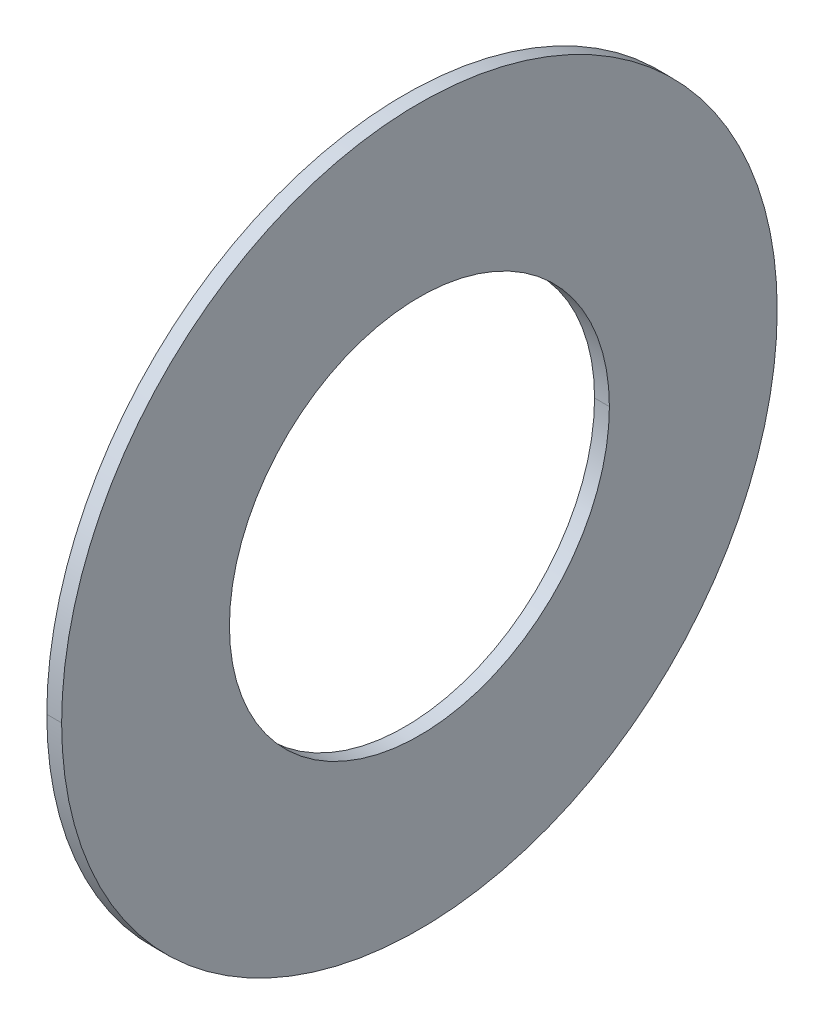
ISO-10303-21;
HEADER;
FILE_DESCRIPTION(('STEP AP214'),'2;1');
FILE_NAME('part.step','',(''),(''),'','','');
FILE_SCHEMA(('AUTOMOTIVE_DESIGN { 1 0 10303 214 1 1 1 1 }'));
ENDSEC;
DATA;
#1=APPLICATION_CONTEXT('core data for automotive mechanical design processes');
#2=APPLICATION_PROTOCOL_DEFINITION('international standard','automotive_design',2000,#1);
#3=PRODUCT_CONTEXT('',#1,'mechanical');
#4=PRODUCT('Part','Part','',(#3));
#5=PRODUCT_RELATED_PRODUCT_CATEGORY('part','',(#4));
#6=PRODUCT_DEFINITION_FORMATION('','',#4);
#7=PRODUCT_DEFINITION_CONTEXT('part definition',#1,'design');
#8=PRODUCT_DEFINITION('design','',#6,#7);
#9=PRODUCT_DEFINITION_SHAPE('','',#8);
#10=(LENGTH_UNIT() NAMED_UNIT(*) SI_UNIT(.MILLI.,.METRE.));
#11=(NAMED_UNIT(*) PLANE_ANGLE_UNIT() SI_UNIT($,.RADIAN.));
#12=(NAMED_UNIT(*) SI_UNIT($,.STERADIAN.) SOLID_ANGLE_UNIT());
#13=UNCERTAINTY_MEASURE_WITH_UNIT(LENGTH_MEASURE(1.E-05),#10,'distance_accuracy_value','');
#14=(GEOMETRIC_REPRESENTATION_CONTEXT(3) GLOBAL_UNCERTAINTY_ASSIGNED_CONTEXT((#13)) GLOBAL_UNIT_ASSIGNED_CONTEXT((#10,
#11,#12)) REPRESENTATION_CONTEXT('',''));
#15=CARTESIAN_POINT('',(0.,0.,0.));
#16=DIRECTION('',(0.,0.,1.));
#17=DIRECTION('',(1.,0.,0.));
#18=AXIS2_PLACEMENT_3D('',#15,#16,#17);
#19=CARTESIAN_POINT('',(4.6875,5.65,0.));
#20=DIRECTION('',(-1.,0.,0.));
#21=DIRECTION('',(0.,0.,1.));
#22=AXIS2_PLACEMENT_3D('',#19,#20,#21);
#23=PLANE('',#22);
#24=CARTESIAN_POINT('',(4.6875,0.,0.));
#25=DIRECTION('',(1.,0.,0.));
#26=DIRECTION('',(0.,0.,-1.));
#27=AXIS2_PLACEMENT_3D('',#24,#25,#26);
#28=CIRCLE('',#27,3.);
#29=CARTESIAN_POINT('',(4.6875,0.,-3.));
#30=VERTEX_POINT('',#29);
#31=CARTESIAN_POINT('',(4.6875,0.,3.));
#32=VERTEX_POINT('',#31);
#33=EDGE_CURVE('E11',#30,#32,#28,.T.);
#34=ORIENTED_EDGE('',*,*,#33,.T.);
#35=CARTESIAN_POINT('',(4.6875,0.,0.));
#36=DIRECTION('',(1.,0.,0.));
#37=DIRECTION('',(0.,0.,-1.));
#38=AXIS2_PLACEMENT_3D('',#35,#36,#37);
#39=CIRCLE('',#38,3.);
#40=EDGE_CURVE('E25',#32,#30,#39,.T.);
#41=ORIENTED_EDGE('',*,*,#40,.T.);
#42=EDGE_LOOP('',(#34,#41));
#43=FACE_BOUND('',#42,.T.);
#44=CARTESIAN_POINT('',(4.6875,0.,0.));
#45=DIRECTION('',(1.,0.,0.));
#46=DIRECTION('',(0.,0.,-1.));
#47=AXIS2_PLACEMENT_3D('',#44,#45,#46);
#48=CIRCLE('',#47,5.65);
#49=CARTESIAN_POINT('',(4.6875,0.,-5.65));
#50=VERTEX_POINT('',#49);
#51=CARTESIAN_POINT('',(4.6875,0.,5.65));
#52=VERTEX_POINT('',#51);
#53=EDGE_CURVE('E96',#50,#52,#48,.T.);
#54=ORIENTED_EDGE('',*,*,#53,.F.);
#55=CARTESIAN_POINT('',(4.6875,0.,0.));
#56=DIRECTION('',(1.,0.,0.));
#57=DIRECTION('',(0.,0.,-1.));
#58=AXIS2_PLACEMENT_3D('',#55,#56,#57);
#59=CIRCLE('',#58,5.65);
#60=EDGE_CURVE('E91',#52,#50,#59,.T.);
#61=ORIENTED_EDGE('',*,*,#60,.F.);
#62=EDGE_LOOP('',(#54,#61));
#63=FACE_BOUND('',#62,.T.);
#64=ADVANCED_FACE('F17',(#43,#63),#23,.T.);
#65=CARTESIAN_POINT('',(4.92175,0.,0.));
#66=DIRECTION('',(-1.,0.,0.));
#67=DIRECTION('',(0.,1.,0.));
#68=AXIS2_PLACEMENT_3D('',#65,#66,#67);
#69=CYLINDRICAL_SURFACE('',#68,5.65);
#70=ORIENTED_EDGE('',*,*,#60,.T.);
#71=DIRECTION('',(-1.,0.,0.));
#72=VECTOR('',#71,1.);
#73=CARTESIAN_POINT('',(4.92175,0.,-5.65));
#74=LINE('',#73,#72);
#75=CARTESIAN_POINT('',(4.92175,0.,-5.65));
#76=VERTEX_POINT('',#75);
#77=EDGE_CURVE('E86',#76,#50,#74,.T.);
#78=ORIENTED_EDGE('',*,*,#77,.F.);
#79=CARTESIAN_POINT('',(4.92175,0.,0.));
#80=DIRECTION('',(1.,0.,0.));
#81=DIRECTION('',(0.,0.,-1.));
#82=AXIS2_PLACEMENT_3D('',#79,#80,#81);
#83=CIRCLE('',#82,5.65);
#84=CARTESIAN_POINT('',(4.92175,0.,5.65));
#85=VERTEX_POINT('',#84);
#86=EDGE_CURVE('E81',#85,#76,#83,.T.);
#87=ORIENTED_EDGE('',*,*,#86,.F.);
#88=DIRECTION('',(-1.,0.,0.));
#89=VECTOR('',#88,1.);
#90=CARTESIAN_POINT('',(4.92175,0.,5.65));
#91=LINE('',#90,#89);
#92=EDGE_CURVE('E70',#85,#52,#91,.T.);
#93=ORIENTED_EDGE('',*,*,#92,.T.);
#94=EDGE_LOOP('',(#70,#78,#87,#93));
#95=FACE_BOUND('',#94,.T.);
#96=ADVANCED_FACE('F111',(#95),#69,.T.);
#97=CARTESIAN_POINT('',(4.92175,0.,0.));
#98=DIRECTION('',(-1.,0.,0.));
#99=DIRECTION('',(0.,-1.,0.));
#100=AXIS2_PLACEMENT_3D('',#97,#98,#99);
#101=CYLINDRICAL_SURFACE('',#100,5.65);
#102=CARTESIAN_POINT('',(4.92175,0.,0.));
#103=DIRECTION('',(1.,0.,0.));
#104=DIRECTION('',(0.,0.,-1.));
#105=AXIS2_PLACEMENT_3D('',#102,#103,#104);
#106=CIRCLE('',#105,5.65);
#107=EDGE_CURVE('E67',#76,#85,#106,.T.);
#108=ORIENTED_EDGE('',*,*,#107,.F.);
#109=ORIENTED_EDGE('',*,*,#77,.T.);
#110=ORIENTED_EDGE('',*,*,#53,.T.);
#111=ORIENTED_EDGE('',*,*,#92,.F.);
#112=EDGE_LOOP('',(#108,#109,#110,#111));
#113=FACE_BOUND('',#112,.T.);
#114=ADVANCED_FACE('F108',(#113),#101,.T.);
#115=CARTESIAN_POINT('',(4.92175,3.,0.));
#116=DIRECTION('',(1.,0.,0.));
#117=DIRECTION('',(0.,0.,-1.));
#118=AXIS2_PLACEMENT_3D('',#115,#116,#117);
#119=PLANE('',#118);
#120=ORIENTED_EDGE('',*,*,#107,.T.);
#121=ORIENTED_EDGE('',*,*,#86,.T.);
#122=EDGE_LOOP('',(#120,#121));
#123=FACE_BOUND('',#122,.T.);
#124=CARTESIAN_POINT('',(4.92175,0.,0.));
#125=DIRECTION('',(1.,0.,0.));
#126=DIRECTION('',(0.,0.,-1.));
#127=AXIS2_PLACEMENT_3D('',#124,#125,#126);
#128=CIRCLE('',#127,3.);
#129=CARTESIAN_POINT('',(4.92175,0.,-3.));
#130=VERTEX_POINT('',#129);
#131=CARTESIAN_POINT('',(4.92175,0.,3.));
#132=VERTEX_POINT('',#131);
#133=EDGE_CURVE('E56',#130,#132,#128,.T.);
#134=ORIENTED_EDGE('',*,*,#133,.F.);
#135=CARTESIAN_POINT('',(4.92175,0.,0.));
#136=DIRECTION('',(1.,0.,0.));
#137=DIRECTION('',(0.,0.,-1.));
#138=AXIS2_PLACEMENT_3D('',#135,#136,#137);
#139=CIRCLE('',#138,3.);
#140=EDGE_CURVE('E52',#132,#130,#139,.T.);
#141=ORIENTED_EDGE('',*,*,#140,.F.);
#142=EDGE_LOOP('',(#134,#141));
#143=FACE_BOUND('',#142,.T.);
#144=ADVANCED_FACE('F54',(#123,#143),#119,.T.);
#145=CARTESIAN_POINT('',(4.92175,0.,0.));
#146=DIRECTION('',(-1.,0.,0.));
#147=DIRECTION('',(0.,1.,0.));
#148=AXIS2_PLACEMENT_3D('',#145,#146,#147);
#149=CYLINDRICAL_SURFACE('',#148,3.);
#150=ORIENTED_EDGE('',*,*,#40,.F.);
#151=DIRECTION('',(-1.,0.,0.));
#152=VECTOR('',#151,1.);
#153=CARTESIAN_POINT('',(4.92175,0.,3.));
#154=LINE('',#153,#152);
#155=EDGE_CURVE('E59',#132,#32,#154,.T.);
#156=ORIENTED_EDGE('',*,*,#155,.F.);
#157=ORIENTED_EDGE('',*,*,#140,.T.);
#158=DIRECTION('',(-1.,0.,0.));
#159=VECTOR('',#158,1.);
#160=CARTESIAN_POINT('',(4.92175,0.,-3.));
#161=LINE('',#160,#159);
#162=EDGE_CURVE('E64',#130,#30,#161,.T.);
#163=ORIENTED_EDGE('',*,*,#162,.T.);
#164=EDGE_LOOP('',(#150,#156,#157,#163));
#165=FACE_BOUND('',#164,.T.);
#166=ADVANCED_FACE('F62',(#165),#149,.F.);
#167=CARTESIAN_POINT('',(4.92175,0.,0.));
#168=DIRECTION('',(-1.,0.,0.));
#169=DIRECTION('',(0.,-1.,0.));
#170=AXIS2_PLACEMENT_3D('',#167,#168,#169);
#171=CYLINDRICAL_SURFACE('',#170,3.);
#172=ORIENTED_EDGE('',*,*,#133,.T.);
#173=ORIENTED_EDGE('',*,*,#155,.T.);
#174=ORIENTED_EDGE('',*,*,#33,.F.);
#175=ORIENTED_EDGE('',*,*,#162,.F.);
#176=EDGE_LOOP('',(#172,#173,#174,#175));
#177=FACE_BOUND('',#176,.T.);
#178=ADVANCED_FACE('F66',(#177),#171,.F.);
#179=CLOSED_SHELL('',(#64,#96,#114,#144,#166,#178));
#180=MANIFOLD_SOLID_BREP('B1',#179);
#181=ADVANCED_BREP_SHAPE_REPRESENTATION('',(#18,#180),#14);
#182=SHAPE_DEFINITION_REPRESENTATION(#9,#181);
ENDSEC;
END-ISO-10303-21;
